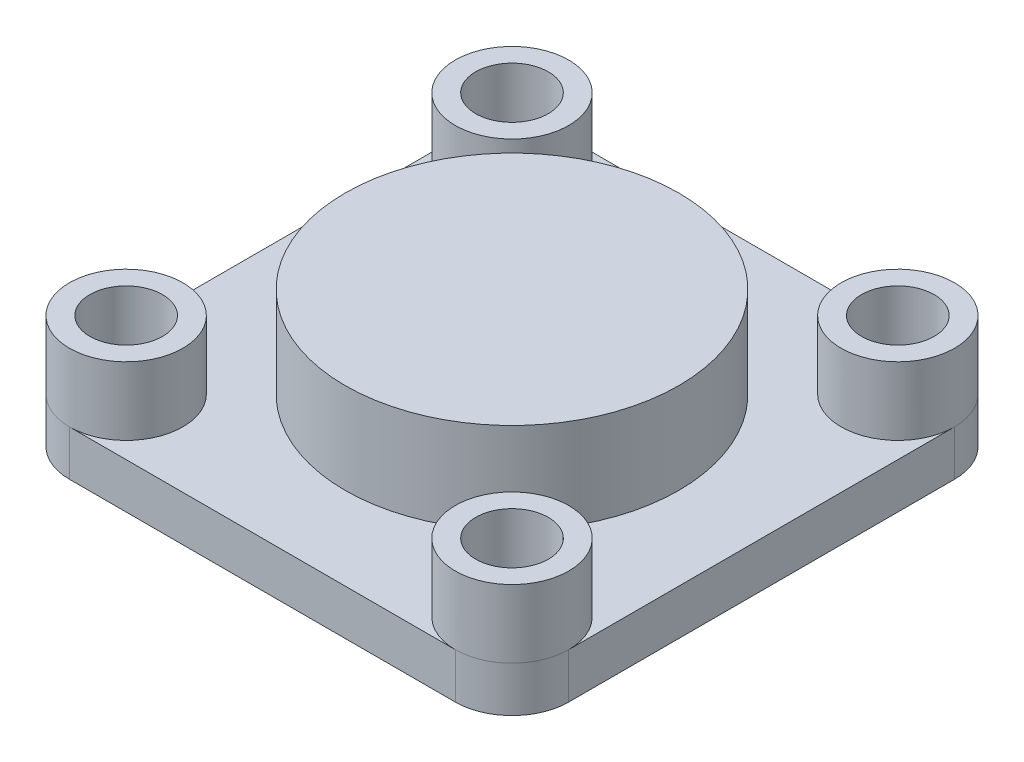
ISO-10303-21;
HEADER;
FILE_DESCRIPTION(('STEP AP214'),'2;1');
FILE_NAME('part.step','',(''),(''),'','','');
FILE_SCHEMA(('AUTOMOTIVE_DESIGN { 1 0 10303 214 1 1 1 1 }'));
ENDSEC;
DATA;
#1=APPLICATION_CONTEXT('core data for automotive mechanical design processes');
#2=APPLICATION_PROTOCOL_DEFINITION('international standard','automotive_design',2000,#1);
#3=PRODUCT_CONTEXT('',#1,'mechanical');
#4=PRODUCT('Part','Part','',(#3));
#5=PRODUCT_RELATED_PRODUCT_CATEGORY('part','',(#4));
#6=PRODUCT_DEFINITION_FORMATION('','',#4);
#7=PRODUCT_DEFINITION_CONTEXT('part definition',#1,'design');
#8=PRODUCT_DEFINITION('design','',#6,#7);
#9=PRODUCT_DEFINITION_SHAPE('','',#8);
#10=(LENGTH_UNIT() NAMED_UNIT(*) SI_UNIT(.MILLI.,.METRE.));
#11=(NAMED_UNIT(*) PLANE_ANGLE_UNIT() SI_UNIT($,.RADIAN.));
#12=(NAMED_UNIT(*) SI_UNIT($,.STERADIAN.) SOLID_ANGLE_UNIT());
#13=UNCERTAINTY_MEASURE_WITH_UNIT(LENGTH_MEASURE(1.E-05),#10,'distance_accuracy_value','');
#14=(GEOMETRIC_REPRESENTATION_CONTEXT(3) GLOBAL_UNCERTAINTY_ASSIGNED_CONTEXT((#13)) GLOBAL_UNIT_ASSIGNED_CONTEXT((#10,
#11,#12)) REPRESENTATION_CONTEXT('',''));
#15=CARTESIAN_POINT('',(0.,0.,0.));
#16=DIRECTION('',(0.,0.,1.));
#17=DIRECTION('',(1.,0.,0.));
#18=AXIS2_PLACEMENT_3D('',#15,#16,#17);
#19=CARTESIAN_POINT('',(0.,2.,0.));
#20=DIRECTION('',(0.,1.,0.));
#21=DIRECTION('',(0.,0.,1.));
#22=AXIS2_PLACEMENT_3D('',#19,#20,#21);
#23=PLANE('',#22);
#24=CARTESIAN_POINT('',(0.,2.,0.));
#25=DIRECTION('',(0.,1.,0.));
#26=DIRECTION('',(0.,0.,1.));
#27=AXIS2_PLACEMENT_3D('',#24,#25,#26);
#28=CIRCLE('',#27,7.35);
#29=CARTESIAN_POINT('',(0.,2.,7.35));
#30=VERTEX_POINT('',#29);
#31=EDGE_CURVE('E172',#30,#30,#28,.T.);
#32=ORIENTED_EDGE('',*,*,#31,.F.);
#33=EDGE_LOOP('',(#32));
#34=FACE_BOUND('',#33,.T.);
#35=DIRECTION('',(1.,0.,0.));
#36=VECTOR('',#35,1.);
#37=CARTESIAN_POINT('',(-11.,2.,11.));
#38=LINE('',#37,#36);
#39=CARTESIAN_POINT('',(-8.5,2.,11.));
#40=VERTEX_POINT('',#39);
#41=CARTESIAN_POINT('',(8.49999999999991,2.,11.));
#42=VERTEX_POINT('',#41);
#43=EDGE_CURVE('E124',#40,#42,#38,.T.);
#44=ORIENTED_EDGE('',*,*,#43,.T.);
#45=CARTESIAN_POINT('',(8.49999999999991,2.,8.50000000000009));
#46=DIRECTION('',(0.,1.,0.));
#47=DIRECTION('',(1.,0.,0.));
#48=AXIS2_PLACEMENT_3D('',#45,#46,#47);
#49=CIRCLE('',#48,2.5);
#50=CARTESIAN_POINT('',(10.9999999999999,2.,8.50000000000009));
#51=VERTEX_POINT('',#50);
#52=EDGE_CURVE('E108',#51,#42,#49,.T.);
#53=ORIENTED_EDGE('',*,*,#52,.F.);
#54=DIRECTION('',(0.,0.,-1.));
#55=VECTOR('',#54,1.);
#56=CARTESIAN_POINT('',(11.,2.,-11.));
#57=LINE('',#56,#55);
#58=CARTESIAN_POINT('',(11.,2.,-8.5));
#59=VERTEX_POINT('',#58);
#60=EDGE_CURVE('E120',#51,#59,#57,.T.);
#61=ORIENTED_EDGE('',*,*,#60,.T.);
#62=CARTESIAN_POINT('',(8.5,2.,-8.5));
#63=DIRECTION('',(0.,1.,0.));
#64=DIRECTION('',(0.,0.,-1.));
#65=AXIS2_PLACEMENT_3D('',#62,#63,#64);
#66=CIRCLE('',#65,2.5);
#67=CARTESIAN_POINT('',(8.5,2.,-11.));
#68=VERTEX_POINT('',#67);
#69=EDGE_CURVE('E334',#68,#59,#66,.T.);
#70=ORIENTED_EDGE('',*,*,#69,.F.);
#71=DIRECTION('',(-1.,0.,0.));
#72=VECTOR('',#71,1.);
#73=CARTESIAN_POINT('',(-11.,2.,-11.));
#74=LINE('',#73,#72);
#75=CARTESIAN_POINT('',(-8.49999999999997,2.,-11.));
#76=VERTEX_POINT('',#75);
#77=EDGE_CURVE('E135',#68,#76,#74,.T.);
#78=ORIENTED_EDGE('',*,*,#77,.T.);
#79=CARTESIAN_POINT('',(-8.49999999999997,2.,-8.50000000000003));
#80=DIRECTION('',(0.,1.,0.));
#81=DIRECTION('',(-1.,0.,0.));
#82=AXIS2_PLACEMENT_3D('',#79,#80,#81);
#83=CIRCLE('',#82,2.5);
#84=CARTESIAN_POINT('',(-11.,2.,-8.50000000000003));
#85=VERTEX_POINT('',#84);
#86=EDGE_CURVE('E195',#85,#76,#83,.T.);
#87=ORIENTED_EDGE('',*,*,#86,.F.);
#88=DIRECTION('',(0.,0.,1.));
#89=VECTOR('',#88,1.);
#90=CARTESIAN_POINT('',(-11.,2.,-11.));
#91=LINE('',#90,#89);
#92=CARTESIAN_POINT('',(-11.,2.,8.5));
#93=VERTEX_POINT('',#92);
#94=EDGE_CURVE('E168',#85,#93,#91,.T.);
#95=ORIENTED_EDGE('',*,*,#94,.T.);
#96=CARTESIAN_POINT('',(-8.5,2.,8.5));
#97=DIRECTION('',(0.,1.,0.));
#98=DIRECTION('',(0.,0.,1.));
#99=AXIS2_PLACEMENT_3D('',#96,#97,#98);
#100=CIRCLE('',#99,2.5);
#101=EDGE_CURVE('E245',#40,#93,#100,.T.);
#102=ORIENTED_EDGE('',*,*,#101,.F.);
#103=EDGE_LOOP('',(#44,#53,#61,#70,#78,#87,#95,#102));
#104=FACE_BOUND('',#103,.T.);
#105=ADVANCED_FACE('F39',(#34,#104),#23,.T.);
#106=CARTESIAN_POINT('',(-11.,2.,-11.));
#107=DIRECTION('',(1.,0.,0.));
#108=DIRECTION('',(0.,0.,-1.));
#109=AXIS2_PLACEMENT_3D('',#106,#107,#108);
#110=PLANE('',#109);
#111=ORIENTED_EDGE('',*,*,#94,.F.);
#112=DIRECTION('',(0.,-1.,0.));
#113=VECTOR('',#112,1.);
#114=CARTESIAN_POINT('',(-11.,2.,-8.5));
#115=LINE('',#114,#113);
#116=CARTESIAN_POINT('',(-11.,0.,-8.5));
#117=VERTEX_POINT('',#116);
#118=EDGE_CURVE('E147',#85,#117,#115,.T.);
#119=ORIENTED_EDGE('',*,*,#118,.T.);
#120=DIRECTION('',(0.,0.,1.));
#121=VECTOR('',#120,1.);
#122=CARTESIAN_POINT('',(-11.,0.,-11.));
#123=LINE('',#122,#121);
#124=CARTESIAN_POINT('',(-11.,0.,8.5));
#125=VERTEX_POINT('',#124);
#126=EDGE_CURVE('E158',#117,#125,#123,.T.);
#127=ORIENTED_EDGE('',*,*,#126,.T.);
#128=DIRECTION('',(0.,-1.,0.));
#129=VECTOR('',#128,1.);
#130=CARTESIAN_POINT('',(-11.,2.,8.5));
#131=LINE('',#130,#129);
#132=EDGE_CURVE('E140',#125,#93,#131,.F.);
#133=ORIENTED_EDGE('',*,*,#132,.T.);
#134=EDGE_LOOP('',(#111,#119,#127,#133));
#135=FACE_BOUND('',#134,.T.);
#136=ADVANCED_FACE('F203',(#135),#110,.F.);
#137=CARTESIAN_POINT('',(-11.,2.,11.));
#138=DIRECTION('',(0.,0.,-1.));
#139=DIRECTION('',(-1.,0.,0.));
#140=AXIS2_PLACEMENT_3D('',#137,#138,#139);
#141=PLANE('',#140);
#142=DIRECTION('',(1.,0.,0.));
#143=VECTOR('',#142,1.);
#144=CARTESIAN_POINT('',(-11.,0.,11.));
#145=LINE('',#144,#143);
#146=CARTESIAN_POINT('',(-8.5,0.,11.));
#147=VERTEX_POINT('',#146);
#148=CARTESIAN_POINT('',(8.5,0.,11.));
#149=VERTEX_POINT('',#148);
#150=EDGE_CURVE('E151',#147,#149,#145,.T.);
#151=ORIENTED_EDGE('',*,*,#150,.T.);
#152=DIRECTION('',(0.,-1.,0.));
#153=VECTOR('',#152,1.);
#154=CARTESIAN_POINT('',(8.5,2.,11.));
#155=LINE('',#154,#153);
#156=EDGE_CURVE('E11',#149,#42,#155,.F.);
#157=ORIENTED_EDGE('',*,*,#156,.T.);
#158=ORIENTED_EDGE('',*,*,#43,.F.);
#159=DIRECTION('',(0.,-1.,0.));
#160=VECTOR('',#159,1.);
#161=CARTESIAN_POINT('',(-8.5,2.,11.));
#162=LINE('',#161,#160);
#163=EDGE_CURVE('E47',#40,#147,#162,.T.);
#164=ORIENTED_EDGE('',*,*,#163,.T.);
#165=EDGE_LOOP('',(#151,#157,#158,#164));
#166=FACE_BOUND('',#165,.T.);
#167=ADVANCED_FACE('F150',(#166),#141,.F.);
#168=CARTESIAN_POINT('',(11.,2.,-11.));
#169=DIRECTION('',(-1.,0.,0.));
#170=DIRECTION('',(0.,0.,1.));
#171=AXIS2_PLACEMENT_3D('',#168,#169,#170);
#172=PLANE('',#171);
#173=DIRECTION('',(0.,0.,-1.));
#174=VECTOR('',#173,1.);
#175=CARTESIAN_POINT('',(11.,0.,-11.));
#176=LINE('',#175,#174);
#177=CARTESIAN_POINT('',(11.,0.,8.5));
#178=VERTEX_POINT('',#177);
#179=CARTESIAN_POINT('',(11.,0.,-8.5));
#180=VERTEX_POINT('',#179);
#181=EDGE_CURVE('E157',#178,#180,#176,.T.);
#182=ORIENTED_EDGE('',*,*,#181,.T.);
#183=DIRECTION('',(0.,-1.,0.));
#184=VECTOR('',#183,1.);
#185=CARTESIAN_POINT('',(11.,2.,-8.5));
#186=LINE('',#185,#184);
#187=EDGE_CURVE('E134',#180,#59,#186,.F.);
#188=ORIENTED_EDGE('',*,*,#187,.T.);
#189=ORIENTED_EDGE('',*,*,#60,.F.);
#190=DIRECTION('',(0.,-1.,0.));
#191=VECTOR('',#190,1.);
#192=CARTESIAN_POINT('',(11.,2.,8.5));
#193=LINE('',#192,#191);
#194=EDGE_CURVE('E132',#51,#178,#193,.T.);
#195=ORIENTED_EDGE('',*,*,#194,.T.);
#196=EDGE_LOOP('',(#182,#188,#189,#195));
#197=FACE_BOUND('',#196,.T.);
#198=ADVANCED_FACE('F131',(#197),#172,.F.);
#199=CARTESIAN_POINT('',(-11.,2.,-11.));
#200=DIRECTION('',(0.,0.,1.));
#201=DIRECTION('',(1.,0.,0.));
#202=AXIS2_PLACEMENT_3D('',#199,#200,#201);
#203=PLANE('',#202);
#204=ORIENTED_EDGE('',*,*,#77,.F.);
#205=DIRECTION('',(0.,-1.,0.));
#206=VECTOR('',#205,1.);
#207=CARTESIAN_POINT('',(8.49999999999999,2.,-11.));
#208=LINE('',#207,#206);
#209=CARTESIAN_POINT('',(8.49999999999999,0.,-11.));
#210=VERTEX_POINT('',#209);
#211=EDGE_CURVE('E178',#68,#210,#208,.T.);
#212=ORIENTED_EDGE('',*,*,#211,.T.);
#213=DIRECTION('',(-1.,0.,0.));
#214=VECTOR('',#213,1.);
#215=CARTESIAN_POINT('',(-11.,0.,-11.));
#216=LINE('',#215,#214);
#217=CARTESIAN_POINT('',(-8.5,0.,-11.));
#218=VERTEX_POINT('',#217);
#219=EDGE_CURVE('E160',#210,#218,#216,.T.);
#220=ORIENTED_EDGE('',*,*,#219,.T.);
#221=DIRECTION('',(0.,-1.,0.));
#222=VECTOR('',#221,1.);
#223=CARTESIAN_POINT('',(-8.5,2.,-11.));
#224=LINE('',#223,#222);
#225=EDGE_CURVE('E113',#218,#76,#224,.F.);
#226=ORIENTED_EDGE('',*,*,#225,.T.);
#227=EDGE_LOOP('',(#204,#212,#220,#226));
#228=FACE_BOUND('',#227,.T.);
#229=ADVANCED_FACE('F187',(#228),#203,.F.);
#230=CARTESIAN_POINT('',(0.,0.,0.));
#231=DIRECTION('',(0.,1.,0.));
#232=DIRECTION('',(0.,0.,1.));
#233=AXIS2_PLACEMENT_3D('',#230,#231,#232);
#234=PLANE('',#233);
#235=CARTESIAN_POINT('',(-8.49999999999997,0.,-8.50000000000003));
#236=DIRECTION('',(0.,1.,0.));
#237=DIRECTION('',(-1.,0.,0.));
#238=AXIS2_PLACEMENT_3D('',#235,#236,#237);
#239=CIRCLE('',#238,1.6);
#240=CARTESIAN_POINT('',(-10.1,0.,-8.50000000000004));
#241=VERTEX_POINT('',#240);
#242=EDGE_CURVE('E126',#241,#241,#239,.T.);
#243=ORIENTED_EDGE('',*,*,#242,.T.);
#244=EDGE_LOOP('',(#243));
#245=FACE_BOUND('',#244,.T.);
#246=CARTESIAN_POINT('',(8.5,0.,-8.5));
#247=DIRECTION('',(0.,1.,0.));
#248=DIRECTION('',(0.,0.,-1.));
#249=AXIS2_PLACEMENT_3D('',#246,#247,#248);
#250=CIRCLE('',#249,1.6);
#251=CARTESIAN_POINT('',(8.5,0.,-10.1));
#252=VERTEX_POINT('',#251);
#253=EDGE_CURVE('E318',#252,#252,#250,.T.);
#254=ORIENTED_EDGE('',*,*,#253,.T.);
#255=EDGE_LOOP('',(#254));
#256=FACE_BOUND('',#255,.T.);
#257=CARTESIAN_POINT('',(8.49999999999991,0.,8.50000000000009));
#258=DIRECTION('',(0.,1.,0.));
#259=DIRECTION('',(1.,0.,0.));
#260=AXIS2_PLACEMENT_3D('',#257,#258,#259);
#261=CIRCLE('',#260,1.6);
#262=CARTESIAN_POINT('',(10.0999999999999,0.,8.50000000000011));
#263=VERTEX_POINT('',#262);
#264=EDGE_CURVE('E327',#263,#263,#261,.T.);
#265=ORIENTED_EDGE('',*,*,#264,.T.);
#266=EDGE_LOOP('',(#265));
#267=FACE_BOUND('',#266,.T.);
#268=CARTESIAN_POINT('',(-8.5,0.,8.5));
#269=DIRECTION('',(0.,1.,0.));
#270=DIRECTION('',(0.,0.,1.));
#271=AXIS2_PLACEMENT_3D('',#268,#269,#270);
#272=CIRCLE('',#271,1.6);
#273=CARTESIAN_POINT('',(-8.5,0.,10.1));
#274=VERTEX_POINT('',#273);
#275=EDGE_CURVE('E247',#274,#274,#272,.T.);
#276=ORIENTED_EDGE('',*,*,#275,.T.);
#277=EDGE_LOOP('',(#276));
#278=FACE_BOUND('',#277,.T.);
#279=ORIENTED_EDGE('',*,*,#219,.F.);
#280=CARTESIAN_POINT('',(8.49999999999999,0.,-8.5));
#281=DIRECTION('',(0.,1.,0.));
#282=DIRECTION('',(0.,0.,1.));
#283=AXIS2_PLACEMENT_3D('',#280,#281,#282);
#284=CIRCLE('',#283,2.5);
#285=EDGE_CURVE('E138',#210,#180,#284,.F.);
#286=ORIENTED_EDGE('',*,*,#285,.T.);
#287=ORIENTED_EDGE('',*,*,#181,.F.);
#288=CARTESIAN_POINT('',(8.5,0.,8.5));
#289=DIRECTION('',(0.,1.,0.));
#290=DIRECTION('',(0.,0.,1.));
#291=AXIS2_PLACEMENT_3D('',#288,#289,#290);
#292=CIRCLE('',#291,2.5);
#293=EDGE_CURVE('E54',#178,#149,#292,.F.);
#294=ORIENTED_EDGE('',*,*,#293,.T.);
#295=ORIENTED_EDGE('',*,*,#150,.F.);
#296=CARTESIAN_POINT('',(-8.5,0.,8.5));
#297=DIRECTION('',(0.,1.,0.));
#298=DIRECTION('',(0.,0.,1.));
#299=AXIS2_PLACEMENT_3D('',#296,#297,#298);
#300=CIRCLE('',#299,2.5);
#301=EDGE_CURVE('E62',#147,#125,#300,.F.);
#302=ORIENTED_EDGE('',*,*,#301,.T.);
#303=ORIENTED_EDGE('',*,*,#126,.F.);
#304=CARTESIAN_POINT('',(-8.5,0.,-8.5));
#305=DIRECTION('',(0.,1.,0.));
#306=DIRECTION('',(0.,0.,1.));
#307=AXIS2_PLACEMENT_3D('',#304,#305,#306);
#308=CIRCLE('',#307,2.5);
#309=EDGE_CURVE('E142',#117,#218,#308,.F.);
#310=ORIENTED_EDGE('',*,*,#309,.T.);
#311=EDGE_LOOP('',(#279,#286,#287,#294,#295,#302,#303,#310));
#312=FACE_BOUND('',#311,.T.);
#313=ADVANCED_FACE('F154',(#245,#256,#267,#278,#312),#234,.F.);
#314=CARTESIAN_POINT('',(0.,6.,0.));
#315=DIRECTION('',(0.,-1.,0.));
#316=DIRECTION('',(0.,0.,-1.));
#317=AXIS2_PLACEMENT_3D('',#314,#315,#316);
#318=CYLINDRICAL_SURFACE('',#317,7.35);
#319=CARTESIAN_POINT('',(0.,6.,0.));
#320=DIRECTION('',(0.,1.,0.));
#321=DIRECTION('',(0.,0.,1.));
#322=AXIS2_PLACEMENT_3D('',#319,#320,#321);
#323=CIRCLE('',#322,7.35);
#324=CARTESIAN_POINT('',(0.,6.,7.35));
#325=VERTEX_POINT('',#324);
#326=EDGE_CURVE('E162',#325,#325,#323,.T.);
#327=ORIENTED_EDGE('',*,*,#326,.F.);
#328=EDGE_LOOP('',(#327));
#329=FACE_BOUND('',#328,.T.);
#330=ORIENTED_EDGE('',*,*,#31,.T.);
#331=EDGE_LOOP('',(#330));
#332=FACE_BOUND('',#331,.T.);
#333=ADVANCED_FACE('F211',(#329,#332),#318,.T.);
#334=CARTESIAN_POINT('',(0.,6.,0.));
#335=DIRECTION('',(0.,1.,0.));
#336=DIRECTION('',(0.,0.,1.));
#337=AXIS2_PLACEMENT_3D('',#334,#335,#336);
#338=PLANE('',#337);
#339=ORIENTED_EDGE('',*,*,#326,.T.);
#340=EDGE_LOOP('',(#339));
#341=FACE_BOUND('',#340,.T.);
#342=ADVANCED_FACE('F258',(#341),#338,.T.);
#343=CARTESIAN_POINT('',(-8.5,5.,8.5));
#344=DIRECTION('',(0.,-1.,0.));
#345=DIRECTION('',(0.,0.,-1.));
#346=AXIS2_PLACEMENT_3D('',#343,#344,#345);
#347=CYLINDRICAL_SURFACE('',#346,2.5);
#348=CARTESIAN_POINT('',(-8.5,5.,8.5));
#349=DIRECTION('',(0.,1.,0.));
#350=DIRECTION('',(0.,0.,1.));
#351=AXIS2_PLACEMENT_3D('',#348,#349,#350);
#352=CIRCLE('',#351,2.5);
#353=CARTESIAN_POINT('',(-8.5,5.,11.));
#354=VERTEX_POINT('',#353);
#355=EDGE_CURVE('E246',#354,#354,#352,.T.);
#356=ORIENTED_EDGE('',*,*,#355,.F.);
#357=EDGE_LOOP('',(#356));
#358=FACE_BOUND('',#357,.T.);
#359=ORIENTED_EDGE('',*,*,#101,.T.);
#360=CARTESIAN_POINT('',(-8.5,2.,8.5));
#361=DIRECTION('',(0.,1.,0.));
#362=DIRECTION('',(0.,0.,1.));
#363=AXIS2_PLACEMENT_3D('',#360,#361,#362);
#364=CIRCLE('',#363,2.5);
#365=EDGE_CURVE('E169',#40,#93,#364,.F.);
#366=ORIENTED_EDGE('',*,*,#365,.F.);
#367=EDGE_LOOP('',(#359,#366));
#368=FACE_BOUND('',#367,.T.);
#369=ADVANCED_FACE('F244',(#358,#368),#347,.T.);
#370=CARTESIAN_POINT('',(-8.5,5.,8.5));
#371=DIRECTION('',(0.,1.,0.));
#372=DIRECTION('',(0.,0.,1.));
#373=AXIS2_PLACEMENT_3D('',#370,#371,#372);
#374=PLANE('',#373);
#375=CARTESIAN_POINT('',(-8.5,5.,8.5));
#376=DIRECTION('',(0.,1.,0.));
#377=DIRECTION('',(0.,0.,1.));
#378=AXIS2_PLACEMENT_3D('',#375,#376,#377);
#379=CIRCLE('',#378,1.6);
#380=CARTESIAN_POINT('',(-8.5,5.,10.1));
#381=VERTEX_POINT('',#380);
#382=EDGE_CURVE('E252',#381,#381,#379,.T.);
#383=ORIENTED_EDGE('',*,*,#382,.F.);
#384=EDGE_LOOP('',(#383));
#385=FACE_BOUND('',#384,.T.);
#386=ORIENTED_EDGE('',*,*,#355,.T.);
#387=EDGE_LOOP('',(#386));
#388=FACE_BOUND('',#387,.T.);
#389=ADVANCED_FACE('F267',(#385,#388),#374,.T.);
#390=CARTESIAN_POINT('',(-8.5,0.,8.5));
#391=DIRECTION('',(0.,1.,0.));
#392=DIRECTION('',(0.,0.,1.));
#393=AXIS2_PLACEMENT_3D('',#390,#391,#392);
#394=CYLINDRICAL_SURFACE('',#393,1.6);
#395=ORIENTED_EDGE('',*,*,#275,.F.);
#396=EDGE_LOOP('',(#395));
#397=FACE_BOUND('',#396,.T.);
#398=ORIENTED_EDGE('',*,*,#382,.T.);
#399=EDGE_LOOP('',(#398));
#400=FACE_BOUND('',#399,.T.);
#401=ADVANCED_FACE('F273',(#397,#400),#394,.F.);
#402=CARTESIAN_POINT('',(-8.49999999999997,5.,-8.50000000000003));
#403=DIRECTION('',(0.,-1.,0.));
#404=DIRECTION('',(0.,0.,-1.));
#405=AXIS2_PLACEMENT_3D('',#402,#403,#404);
#406=CYLINDRICAL_SURFACE('',#405,2.5);
#407=CARTESIAN_POINT('',(-8.49999999999997,5.,-8.50000000000003));
#408=DIRECTION('',(0.,1.,0.));
#409=DIRECTION('',(-1.,0.,0.));
#410=AXIS2_PLACEMENT_3D('',#407,#408,#409);
#411=CIRCLE('',#410,2.5);
#412=CARTESIAN_POINT('',(-11.,5.,-8.50000000000004));
#413=VERTEX_POINT('',#412);
#414=EDGE_CURVE('E199',#413,#413,#411,.T.);
#415=ORIENTED_EDGE('',*,*,#414,.F.);
#416=EDGE_LOOP('',(#415));
#417=FACE_BOUND('',#416,.T.);
#418=ORIENTED_EDGE('',*,*,#86,.T.);
#419=CARTESIAN_POINT('',(-8.49999999999997,2.,-8.50000000000003));
#420=DIRECTION('',(0.,1.,0.));
#421=DIRECTION('',(0.,0.,1.));
#422=AXIS2_PLACEMENT_3D('',#419,#420,#421);
#423=CIRCLE('',#422,2.5);
#424=EDGE_CURVE('E171',#85,#76,#423,.F.);
#425=ORIENTED_EDGE('',*,*,#424,.F.);
#426=EDGE_LOOP('',(#418,#425));
#427=FACE_BOUND('',#426,.T.);
#428=ADVANCED_FACE('F194',(#417,#427),#406,.T.);
#429=CARTESIAN_POINT('',(-8.49999999999997,5.,-8.50000000000003));
#430=DIRECTION('',(0.,1.,0.));
#431=DIRECTION('',(-1.,0.,0.));
#432=AXIS2_PLACEMENT_3D('',#429,#430,#431);
#433=PLANE('',#432);
#434=CARTESIAN_POINT('',(-8.49999999999997,5.,-8.50000000000003));
#435=DIRECTION('',(0.,1.,0.));
#436=DIRECTION('',(-1.,0.,0.));
#437=AXIS2_PLACEMENT_3D('',#434,#435,#436);
#438=CIRCLE('',#437,1.6);
#439=CARTESIAN_POINT('',(-10.1,5.,-8.50000000000004));
#440=VERTEX_POINT('',#439);
#441=EDGE_CURVE('E317',#440,#440,#438,.T.);
#442=ORIENTED_EDGE('',*,*,#441,.F.);
#443=EDGE_LOOP('',(#442));
#444=FACE_BOUND('',#443,.T.);
#445=ORIENTED_EDGE('',*,*,#414,.T.);
#446=EDGE_LOOP('',(#445));
#447=FACE_BOUND('',#446,.T.);
#448=ADVANCED_FACE('F280',(#444,#447),#433,.T.);
#449=CARTESIAN_POINT('',(8.5,5.,-8.5));
#450=DIRECTION('',(0.,-1.,0.));
#451=DIRECTION('',(0.,0.,-1.));
#452=AXIS2_PLACEMENT_3D('',#449,#450,#451);
#453=CYLINDRICAL_SURFACE('',#452,2.5);
#454=CARTESIAN_POINT('',(8.5,5.,-8.5));
#455=DIRECTION('',(0.,1.,0.));
#456=DIRECTION('',(0.,0.,-1.));
#457=AXIS2_PLACEMENT_3D('',#454,#455,#456);
#458=CIRCLE('',#457,2.5);
#459=CARTESIAN_POINT('',(8.5,5.,-11.));
#460=VERTEX_POINT('',#459);
#461=EDGE_CURVE('E200',#460,#460,#458,.T.);
#462=ORIENTED_EDGE('',*,*,#461,.F.);
#463=EDGE_LOOP('',(#462));
#464=FACE_BOUND('',#463,.T.);
#465=ORIENTED_EDGE('',*,*,#69,.T.);
#466=CARTESIAN_POINT('',(8.5,2.,-8.5));
#467=DIRECTION('',(0.,1.,0.));
#468=DIRECTION('',(0.,0.,1.));
#469=AXIS2_PLACEMENT_3D('',#466,#467,#468);
#470=CIRCLE('',#469,2.5);
#471=EDGE_CURVE('E114',#68,#59,#470,.F.);
#472=ORIENTED_EDGE('',*,*,#471,.F.);
#473=EDGE_LOOP('',(#465,#472));
#474=FACE_BOUND('',#473,.T.);
#475=ADVANCED_FACE('F284',(#464,#474),#453,.T.);
#476=CARTESIAN_POINT('',(8.5,5.,-8.5));
#477=DIRECTION('',(0.,1.,0.));
#478=DIRECTION('',(0.,0.,-1.));
#479=AXIS2_PLACEMENT_3D('',#476,#477,#478);
#480=PLANE('',#479);
#481=CARTESIAN_POINT('',(8.5,5.,-8.5));
#482=DIRECTION('',(0.,1.,0.));
#483=DIRECTION('',(0.,0.,-1.));
#484=AXIS2_PLACEMENT_3D('',#481,#482,#483);
#485=CIRCLE('',#484,1.6);
#486=CARTESIAN_POINT('',(8.5,5.,-10.1));
#487=VERTEX_POINT('',#486);
#488=EDGE_CURVE('E322',#487,#487,#485,.T.);
#489=ORIENTED_EDGE('',*,*,#488,.F.);
#490=EDGE_LOOP('',(#489));
#491=FACE_BOUND('',#490,.T.);
#492=ORIENTED_EDGE('',*,*,#461,.T.);
#493=EDGE_LOOP('',(#492));
#494=FACE_BOUND('',#493,.T.);
#495=ADVANCED_FACE('F288',(#491,#494),#480,.T.);
#496=CARTESIAN_POINT('',(8.49999999999991,5.,8.50000000000009));
#497=DIRECTION('',(0.,-1.,0.));
#498=DIRECTION('',(0.,0.,-1.));
#499=AXIS2_PLACEMENT_3D('',#496,#497,#498);
#500=CYLINDRICAL_SURFACE('',#499,2.5);
#501=CARTESIAN_POINT('',(8.49999999999991,5.,8.50000000000009));
#502=DIRECTION('',(0.,1.,0.));
#503=DIRECTION('',(1.,0.,0.));
#504=AXIS2_PLACEMENT_3D('',#501,#502,#503);
#505=CIRCLE('',#504,2.5);
#506=CARTESIAN_POINT('',(10.9999999999999,5.,8.50000000000012));
#507=VERTEX_POINT('',#506);
#508=EDGE_CURVE('E125',#507,#507,#505,.T.);
#509=ORIENTED_EDGE('',*,*,#508,.F.);
#510=EDGE_LOOP('',(#509));
#511=FACE_BOUND('',#510,.T.);
#512=ORIENTED_EDGE('',*,*,#52,.T.);
#513=CARTESIAN_POINT('',(8.49999999999991,2.,8.50000000000009));
#514=DIRECTION('',(0.,1.,0.));
#515=DIRECTION('',(0.,0.,1.));
#516=AXIS2_PLACEMENT_3D('',#513,#514,#515);
#517=CIRCLE('',#516,2.5);
#518=EDGE_CURVE('E105',#51,#42,#517,.F.);
#519=ORIENTED_EDGE('',*,*,#518,.F.);
#520=EDGE_LOOP('',(#512,#519));
#521=FACE_BOUND('',#520,.T.);
#522=ADVANCED_FACE('F107',(#511,#521),#500,.T.);
#523=CARTESIAN_POINT('',(8.49999999999991,5.,8.50000000000009));
#524=DIRECTION('',(0.,1.,0.));
#525=DIRECTION('',(1.,0.,0.));
#526=AXIS2_PLACEMENT_3D('',#523,#524,#525);
#527=PLANE('',#526);
#528=CARTESIAN_POINT('',(8.49999999999991,5.,8.50000000000009));
#529=DIRECTION('',(0.,1.,0.));
#530=DIRECTION('',(1.,0.,0.));
#531=AXIS2_PLACEMENT_3D('',#528,#529,#530);
#532=CIRCLE('',#531,1.6);
#533=CARTESIAN_POINT('',(10.0999999999999,5.,8.50000000000011));
#534=VERTEX_POINT('',#533);
#535=EDGE_CURVE('E330',#534,#534,#532,.T.);
#536=ORIENTED_EDGE('',*,*,#535,.F.);
#537=EDGE_LOOP('',(#536));
#538=FACE_BOUND('',#537,.T.);
#539=ORIENTED_EDGE('',*,*,#508,.T.);
#540=EDGE_LOOP('',(#539));
#541=FACE_BOUND('',#540,.T.);
#542=ADVANCED_FACE('F295',(#538,#541),#527,.T.);
#543=CARTESIAN_POINT('',(8.49999999999991,0.,8.50000000000009));
#544=DIRECTION('',(0.,1.,0.));
#545=DIRECTION('',(0.,0.,1.));
#546=AXIS2_PLACEMENT_3D('',#543,#544,#545);
#547=CYLINDRICAL_SURFACE('',#546,1.6);
#548=ORIENTED_EDGE('',*,*,#264,.F.);
#549=EDGE_LOOP('',(#548));
#550=FACE_BOUND('',#549,.T.);
#551=ORIENTED_EDGE('',*,*,#535,.T.);
#552=EDGE_LOOP('',(#551));
#553=FACE_BOUND('',#552,.T.);
#554=ADVANCED_FACE('F299',(#550,#553),#547,.F.);
#555=CARTESIAN_POINT('',(8.5,0.,-8.5));
#556=DIRECTION('',(0.,1.,0.));
#557=DIRECTION('',(0.,0.,1.));
#558=AXIS2_PLACEMENT_3D('',#555,#556,#557);
#559=CYLINDRICAL_SURFACE('',#558,1.6);
#560=ORIENTED_EDGE('',*,*,#253,.F.);
#561=EDGE_LOOP('',(#560));
#562=FACE_BOUND('',#561,.T.);
#563=ORIENTED_EDGE('',*,*,#488,.T.);
#564=EDGE_LOOP('',(#563));
#565=FACE_BOUND('',#564,.T.);
#566=ADVANCED_FACE('F303',(#562,#565),#559,.F.);
#567=CARTESIAN_POINT('',(-8.49999999999997,0.,-8.50000000000003));
#568=DIRECTION('',(0.,1.,0.));
#569=DIRECTION('',(0.,0.,1.));
#570=AXIS2_PLACEMENT_3D('',#567,#568,#569);
#571=CYLINDRICAL_SURFACE('',#570,1.6);
#572=ORIENTED_EDGE('',*,*,#242,.F.);
#573=EDGE_LOOP('',(#572));
#574=FACE_BOUND('',#573,.T.);
#575=ORIENTED_EDGE('',*,*,#441,.T.);
#576=EDGE_LOOP('',(#575));
#577=FACE_BOUND('',#576,.T.);
#578=ADVANCED_FACE('F234',(#574,#577),#571,.F.);
#579=CARTESIAN_POINT('',(8.49999999999999,2.,-8.5));
#580=DIRECTION('',(0.,-1.,0.));
#581=DIRECTION('',(0.,0.,-1.));
#582=AXIS2_PLACEMENT_3D('',#579,#580,#581);
#583=CYLINDRICAL_SURFACE('',#582,2.5);
#584=ORIENTED_EDGE('',*,*,#471,.T.);
#585=ORIENTED_EDGE('',*,*,#187,.F.);
#586=ORIENTED_EDGE('',*,*,#285,.F.);
#587=ORIENTED_EDGE('',*,*,#211,.F.);
#588=EDGE_LOOP('',(#584,#585,#586,#587));
#589=FACE_BOUND('',#588,.T.);
#590=ADVANCED_FACE('F231',(#589),#583,.T.);
#591=CARTESIAN_POINT('',(-8.5,2.,-8.5));
#592=DIRECTION('',(0.,-1.,0.));
#593=DIRECTION('',(0.,0.,-1.));
#594=AXIS2_PLACEMENT_3D('',#591,#592,#593);
#595=CYLINDRICAL_SURFACE('',#594,2.5);
#596=ORIENTED_EDGE('',*,*,#424,.T.);
#597=ORIENTED_EDGE('',*,*,#225,.F.);
#598=ORIENTED_EDGE('',*,*,#309,.F.);
#599=ORIENTED_EDGE('',*,*,#118,.F.);
#600=EDGE_LOOP('',(#596,#597,#598,#599));
#601=FACE_BOUND('',#600,.T.);
#602=ADVANCED_FACE('F190',(#601),#595,.T.);
#603=CARTESIAN_POINT('',(8.5,2.,8.5));
#604=DIRECTION('',(0.,-1.,0.));
#605=DIRECTION('',(0.,0.,-1.));
#606=AXIS2_PLACEMENT_3D('',#603,#604,#605);
#607=CYLINDRICAL_SURFACE('',#606,2.5);
#608=ORIENTED_EDGE('',*,*,#518,.T.);
#609=ORIENTED_EDGE('',*,*,#156,.F.);
#610=ORIENTED_EDGE('',*,*,#293,.F.);
#611=ORIENTED_EDGE('',*,*,#194,.F.);
#612=EDGE_LOOP('',(#608,#609,#610,#611));
#613=FACE_BOUND('',#612,.T.);
#614=ADVANCED_FACE('F137',(#613),#607,.T.);
#615=CARTESIAN_POINT('',(-8.5,2.,8.5));
#616=DIRECTION('',(0.,-1.,0.));
#617=DIRECTION('',(0.,0.,-1.));
#618=AXIS2_PLACEMENT_3D('',#615,#616,#617);
#619=CYLINDRICAL_SURFACE('',#618,2.5);
#620=ORIENTED_EDGE('',*,*,#365,.T.);
#621=ORIENTED_EDGE('',*,*,#132,.F.);
#622=ORIENTED_EDGE('',*,*,#301,.F.);
#623=ORIENTED_EDGE('',*,*,#163,.F.);
#624=EDGE_LOOP('',(#620,#621,#622,#623));
#625=FACE_BOUND('',#624,.T.);
#626=ADVANCED_FACE('F41',(#625),#619,.T.);
#627=CLOSED_SHELL('',(#105,#136,#167,#198,#229,#313,#333,#342,#369,#389,#401,#428,#448,#475,
#495,#522,#542,#554,#566,#578,#590,#602,#614,#626));
#628=MANIFOLD_SOLID_BREP('B2',#627);
#629=ADVANCED_BREP_SHAPE_REPRESENTATION('',(#18,#628),#14);
#630=SHAPE_DEFINITION_REPRESENTATION(#9,#629);
ENDSEC;
END-ISO-10303-21;
